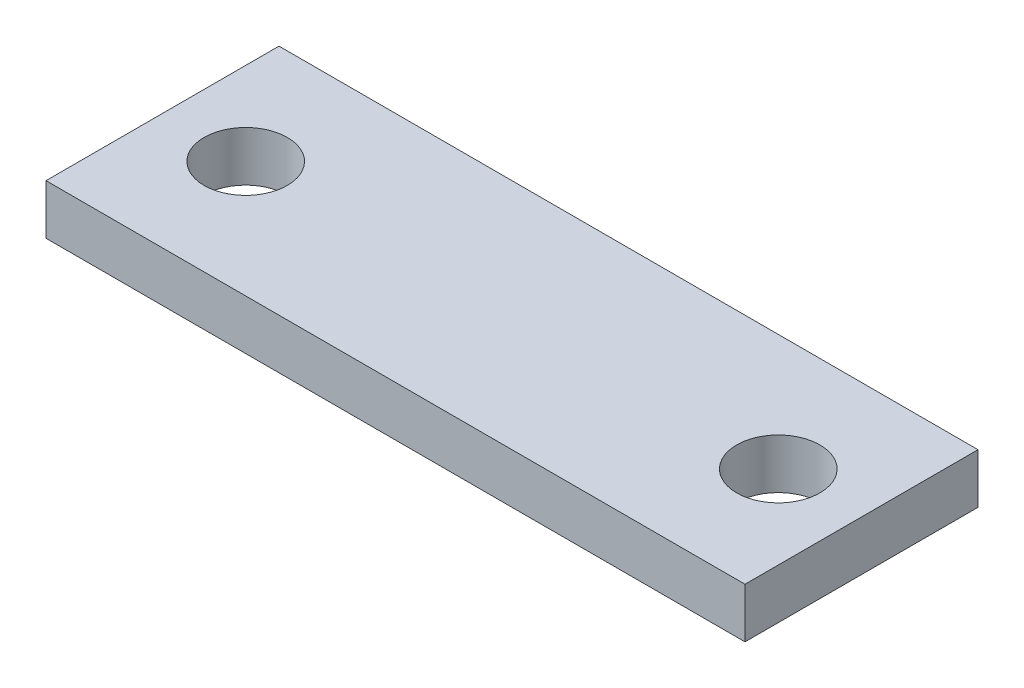
ISO-10303-21;
HEADER;
FILE_DESCRIPTION(('STEP AP214'),'2;1');
FILE_NAME('part.step','',(''),(''),'','','');
FILE_SCHEMA(('AUTOMOTIVE_DESIGN { 1 0 10303 214 1 1 1 1 }'));
ENDSEC;
DATA;
#1=APPLICATION_CONTEXT('core data for automotive mechanical design processes');
#2=APPLICATION_PROTOCOL_DEFINITION('international standard','automotive_design',2000,#1);
#3=PRODUCT_CONTEXT('',#1,'mechanical');
#4=PRODUCT('Part','Part','',(#3));
#5=PRODUCT_RELATED_PRODUCT_CATEGORY('part','',(#4));
#6=PRODUCT_DEFINITION_FORMATION('','',#4);
#7=PRODUCT_DEFINITION_CONTEXT('part definition',#1,'design');
#8=PRODUCT_DEFINITION('design','',#6,#7);
#9=PRODUCT_DEFINITION_SHAPE('','',#8);
#10=(LENGTH_UNIT() NAMED_UNIT(*) SI_UNIT(.MILLI.,.METRE.));
#11=(NAMED_UNIT(*) PLANE_ANGLE_UNIT() SI_UNIT($,.RADIAN.));
#12=(NAMED_UNIT(*) SI_UNIT($,.STERADIAN.) SOLID_ANGLE_UNIT());
#13=UNCERTAINTY_MEASURE_WITH_UNIT(LENGTH_MEASURE(1.E-05),#10,'distance_accuracy_value','');
#14=(GEOMETRIC_REPRESENTATION_CONTEXT(3) GLOBAL_UNCERTAINTY_ASSIGNED_CONTEXT((#13)) GLOBAL_UNIT_ASSIGNED_CONTEXT((#10,
#11,#12)) REPRESENTATION_CONTEXT('',''));
#15=CARTESIAN_POINT('',(0.,0.,0.));
#16=DIRECTION('',(0.,0.,1.));
#17=DIRECTION('',(1.,0.,0.));
#18=AXIS2_PLACEMENT_3D('',#15,#16,#17);
#19=CARTESIAN_POINT('',(0.,3.,0.));
#20=DIRECTION('',(0.,1.,0.));
#21=DIRECTION('',(0.,0.,1.));
#22=AXIS2_PLACEMENT_3D('',#19,#20,#21);
#23=PLANE('',#22);
#24=CARTESIAN_POINT('',(-16.44,3.,-5.5333333333333));
#25=DIRECTION('',(0.,1.,0.));
#26=DIRECTION('',(0.,0.,1.));
#27=AXIS2_PLACEMENT_3D('',#24,#25,#26);
#28=CIRCLE('',#27,2.5);
#29=CARTESIAN_POINT('',(-16.44,3.,-3.0333333333333));
#30=VERTEX_POINT('',#29);
#31=EDGE_CURVE('E112',#30,#30,#28,.T.);
#32=ORIENTED_EDGE('',*,*,#31,.F.);
#33=EDGE_LOOP('',(#32));
#34=FACE_BOUND('',#33,.T.);
#35=DIRECTION('',(0.,0.,1.));
#36=VECTOR('',#35,1.);
#37=CARTESIAN_POINT('',(-21.44,3.,-12.5333333333333));
#38=LINE('',#37,#36);
#39=CARTESIAN_POINT('',(-21.44,3.,-12.5333333333333));
#40=VERTEX_POINT('',#39);
#41=CARTESIAN_POINT('',(-21.44,3.,1.4666666666667));
#42=VERTEX_POINT('',#41);
#43=EDGE_CURVE('E92',#40,#42,#38,.T.);
#44=ORIENTED_EDGE('',*,*,#43,.T.);
#45=DIRECTION('',(1.,0.,0.));
#46=VECTOR('',#45,1.);
#47=CARTESIAN_POINT('',(-21.44,3.,1.4666666666667));
#48=LINE('',#47,#46);
#49=CARTESIAN_POINT('',(20.56,3.,1.4666666666667));
#50=VERTEX_POINT('',#49);
#51=EDGE_CURVE('E87',#42,#50,#48,.T.);
#52=ORIENTED_EDGE('',*,*,#51,.T.);
#53=DIRECTION('',(0.,0.,-1.));
#54=VECTOR('',#53,1.);
#55=CARTESIAN_POINT('',(20.56,3.,-12.5333333333333));
#56=LINE('',#55,#54);
#57=CARTESIAN_POINT('',(20.56,3.,-12.5333333333333));
#58=VERTEX_POINT('',#57);
#59=EDGE_CURVE('E90',#50,#58,#56,.T.);
#60=ORIENTED_EDGE('',*,*,#59,.T.);
#61=DIRECTION('',(-1.,0.,0.));
#62=VECTOR('',#61,1.);
#63=CARTESIAN_POINT('',(-21.44,3.,-12.5333333333333));
#64=LINE('',#63,#62);
#65=EDGE_CURVE('E57',#58,#40,#64,.T.);
#66=ORIENTED_EDGE('',*,*,#65,.T.);
#67=EDGE_LOOP('',(#44,#52,#60,#66));
#68=FACE_BOUND('',#67,.T.);
#69=CARTESIAN_POINT('',(15.56,3.,-5.5333333333333));
#70=DIRECTION('',(0.,1.,0.));
#71=DIRECTION('',(0.,0.,1.));
#72=AXIS2_PLACEMENT_3D('',#69,#70,#71);
#73=CIRCLE('',#72,2.49999999999999);
#74=CARTESIAN_POINT('',(15.56,3.,-3.0333333333333));
#75=VERTEX_POINT('',#74);
#76=EDGE_CURVE('E134',#75,#75,#73,.T.);
#77=ORIENTED_EDGE('',*,*,#76,.F.);
#78=EDGE_LOOP('',(#77));
#79=FACE_BOUND('',#78,.T.);
#80=ADVANCED_FACE('F39',(#34,#68,#79),#23,.T.);
#81=CARTESIAN_POINT('',(0.,0.,0.));
#82=DIRECTION('',(0.,1.,0.));
#83=DIRECTION('',(0.,0.,1.));
#84=AXIS2_PLACEMENT_3D('',#81,#82,#83);
#85=PLANE('',#84);
#86=DIRECTION('',(0.,0.,1.));
#87=VECTOR('',#86,1.);
#88=CARTESIAN_POINT('',(-21.44,0.,-12.5333333333333));
#89=LINE('',#88,#87);
#90=CARTESIAN_POINT('',(-21.44,0.,-12.5333333333333));
#91=VERTEX_POINT('',#90);
#92=CARTESIAN_POINT('',(-21.44,0.,1.4666666666667));
#93=VERTEX_POINT('',#92);
#94=EDGE_CURVE('E108',#91,#93,#89,.T.);
#95=ORIENTED_EDGE('',*,*,#94,.F.);
#96=DIRECTION('',(-1.,0.,0.));
#97=VECTOR('',#96,1.);
#98=CARTESIAN_POINT('',(-21.44,0.,-12.5333333333333));
#99=LINE('',#98,#97);
#100=CARTESIAN_POINT('',(20.56,0.,-12.5333333333333));
#101=VERTEX_POINT('',#100);
#102=EDGE_CURVE('E80',#101,#91,#99,.T.);
#103=ORIENTED_EDGE('',*,*,#102,.F.);
#104=DIRECTION('',(0.,0.,-1.));
#105=VECTOR('',#104,1.);
#106=CARTESIAN_POINT('',(20.56,0.,-12.5333333333333));
#107=LINE('',#106,#105);
#108=CARTESIAN_POINT('',(20.56,0.,1.4666666666667));
#109=VERTEX_POINT('',#108);
#110=EDGE_CURVE('E74',#109,#101,#107,.T.);
#111=ORIENTED_EDGE('',*,*,#110,.F.);
#112=DIRECTION('',(1.,0.,0.));
#113=VECTOR('',#112,1.);
#114=CARTESIAN_POINT('',(-21.44,0.,1.4666666666667));
#115=LINE('',#114,#113);
#116=EDGE_CURVE('E97',#93,#109,#115,.T.);
#117=ORIENTED_EDGE('',*,*,#116,.F.);
#118=EDGE_LOOP('',(#95,#103,#111,#117));
#119=FACE_BOUND('',#118,.T.);
#120=CARTESIAN_POINT('',(-16.44,0.,-5.5333333333333));
#121=DIRECTION('',(0.,1.,0.));
#122=DIRECTION('',(0.,0.,1.));
#123=AXIS2_PLACEMENT_3D('',#120,#121,#122);
#124=CIRCLE('',#123,2.5);
#125=CARTESIAN_POINT('',(-16.44,0.,-3.0333333333333));
#126=VERTEX_POINT('',#125);
#127=EDGE_CURVE('E130',#126,#126,#124,.T.);
#128=ORIENTED_EDGE('',*,*,#127,.T.);
#129=EDGE_LOOP('',(#128));
#130=FACE_BOUND('',#129,.T.);
#131=CARTESIAN_POINT('',(15.56,0.,-5.5333333333333));
#132=DIRECTION('',(0.,1.,0.));
#133=DIRECTION('',(0.,0.,1.));
#134=AXIS2_PLACEMENT_3D('',#131,#132,#133);
#135=CIRCLE('',#134,2.49999999999999);
#136=CARTESIAN_POINT('',(15.56,0.,-3.0333333333333));
#137=VERTEX_POINT('',#136);
#138=EDGE_CURVE('E138',#137,#137,#135,.T.);
#139=ORIENTED_EDGE('',*,*,#138,.T.);
#140=EDGE_LOOP('',(#139));
#141=FACE_BOUND('',#140,.T.);
#142=ADVANCED_FACE('F125',(#119,#130,#141),#85,.F.);
#143=CARTESIAN_POINT('',(-21.44,3.,-12.5333333333333));
#144=DIRECTION('',(1.,0.,0.));
#145=DIRECTION('',(0.,0.,-1.));
#146=AXIS2_PLACEMENT_3D('',#143,#144,#145);
#147=PLANE('',#146);
#148=ORIENTED_EDGE('',*,*,#94,.T.);
#149=DIRECTION('',(0.,-1.,0.));
#150=VECTOR('',#149,1.);
#151=CARTESIAN_POINT('',(-21.44,3.,1.4666666666667));
#152=LINE('',#151,#150);
#153=EDGE_CURVE('E11',#42,#93,#152,.T.);
#154=ORIENTED_EDGE('',*,*,#153,.F.);
#155=ORIENTED_EDGE('',*,*,#43,.F.);
#156=DIRECTION('',(0.,-1.,0.));
#157=VECTOR('',#156,1.);
#158=CARTESIAN_POINT('',(-21.44,3.,-12.5333333333333));
#159=LINE('',#158,#157);
#160=EDGE_CURVE('E104',#40,#91,#159,.T.);
#161=ORIENTED_EDGE('',*,*,#160,.T.);
#162=EDGE_LOOP('',(#148,#154,#155,#161));
#163=FACE_BOUND('',#162,.T.);
#164=ADVANCED_FACE('F41',(#163),#147,.F.);
#165=CARTESIAN_POINT('',(-21.44,3.,1.4666666666667));
#166=DIRECTION('',(0.,0.,-1.));
#167=DIRECTION('',(-1.,0.,0.));
#168=AXIS2_PLACEMENT_3D('',#165,#166,#167);
#169=PLANE('',#168);
#170=ORIENTED_EDGE('',*,*,#116,.T.);
#171=DIRECTION('',(0.,-1.,0.));
#172=VECTOR('',#171,1.);
#173=CARTESIAN_POINT('',(20.56,3.,1.4666666666667));
#174=LINE('',#173,#172);
#175=EDGE_CURVE('E49',#50,#109,#174,.T.);
#176=ORIENTED_EDGE('',*,*,#175,.F.);
#177=ORIENTED_EDGE('',*,*,#51,.F.);
#178=ORIENTED_EDGE('',*,*,#153,.T.);
#179=EDGE_LOOP('',(#170,#176,#177,#178));
#180=FACE_BOUND('',#179,.T.);
#181=ADVANCED_FACE('F96',(#180),#169,.F.);
#182=CARTESIAN_POINT('',(20.56,3.,-12.5333333333333));
#183=DIRECTION('',(-1.,0.,0.));
#184=DIRECTION('',(0.,0.,1.));
#185=AXIS2_PLACEMENT_3D('',#182,#183,#184);
#186=PLANE('',#185);
#187=ORIENTED_EDGE('',*,*,#110,.T.);
#188=DIRECTION('',(0.,-1.,0.));
#189=VECTOR('',#188,1.);
#190=CARTESIAN_POINT('',(20.56,3.,-12.5333333333333));
#191=LINE('',#190,#189);
#192=EDGE_CURVE('E99',#58,#101,#191,.T.);
#193=ORIENTED_EDGE('',*,*,#192,.F.);
#194=ORIENTED_EDGE('',*,*,#59,.F.);
#195=ORIENTED_EDGE('',*,*,#175,.T.);
#196=EDGE_LOOP('',(#187,#193,#194,#195));
#197=FACE_BOUND('',#196,.T.);
#198=ADVANCED_FACE('F100',(#197),#186,.F.);
#199=CARTESIAN_POINT('',(-21.44,3.,-12.5333333333333));
#200=DIRECTION('',(0.,0.,1.));
#201=DIRECTION('',(1.,0.,0.));
#202=AXIS2_PLACEMENT_3D('',#199,#200,#201);
#203=PLANE('',#202);
#204=ORIENTED_EDGE('',*,*,#102,.T.);
#205=ORIENTED_EDGE('',*,*,#160,.F.);
#206=ORIENTED_EDGE('',*,*,#65,.F.);
#207=ORIENTED_EDGE('',*,*,#192,.T.);
#208=EDGE_LOOP('',(#204,#205,#206,#207));
#209=FACE_BOUND('',#208,.T.);
#210=ADVANCED_FACE('F122',(#209),#203,.F.);
#211=CARTESIAN_POINT('',(-16.44,3.,-5.5333333333333));
#212=DIRECTION('',(0.,-1.,0.));
#213=DIRECTION('',(0.,0.,-1.));
#214=AXIS2_PLACEMENT_3D('',#211,#212,#213);
#215=CYLINDRICAL_SURFACE('',#214,2.5);
#216=ORIENTED_EDGE('',*,*,#31,.T.);
#217=EDGE_LOOP('',(#216));
#218=FACE_BOUND('',#217,.T.);
#219=ORIENTED_EDGE('',*,*,#127,.F.);
#220=EDGE_LOOP('',(#219));
#221=FACE_BOUND('',#220,.T.);
#222=ADVANCED_FACE('F157',(#218,#221),#215,.F.);
#223=CARTESIAN_POINT('',(15.56,3.,-5.5333333333333));
#224=DIRECTION('',(0.,-1.,0.));
#225=DIRECTION('',(0.,0.,-1.));
#226=AXIS2_PLACEMENT_3D('',#223,#224,#225);
#227=CYLINDRICAL_SURFACE('',#226,2.49999999999999);
#228=ORIENTED_EDGE('',*,*,#76,.T.);
#229=EDGE_LOOP('',(#228));
#230=FACE_BOUND('',#229,.T.);
#231=ORIENTED_EDGE('',*,*,#138,.F.);
#232=EDGE_LOOP('',(#231));
#233=FACE_BOUND('',#232,.T.);
#234=ADVANCED_FACE('F146',(#230,#233),#227,.F.);
#235=CLOSED_SHELL('',(#80,#142,#164,#181,#198,#210,#222,#234));
#236=MANIFOLD_SOLID_BREP('B2',#235);
#237=ADVANCED_BREP_SHAPE_REPRESENTATION('',(#18,#236),#14);
#238=SHAPE_DEFINITION_REPRESENTATION(#9,#237);
ENDSEC;
END-ISO-10303-21;
